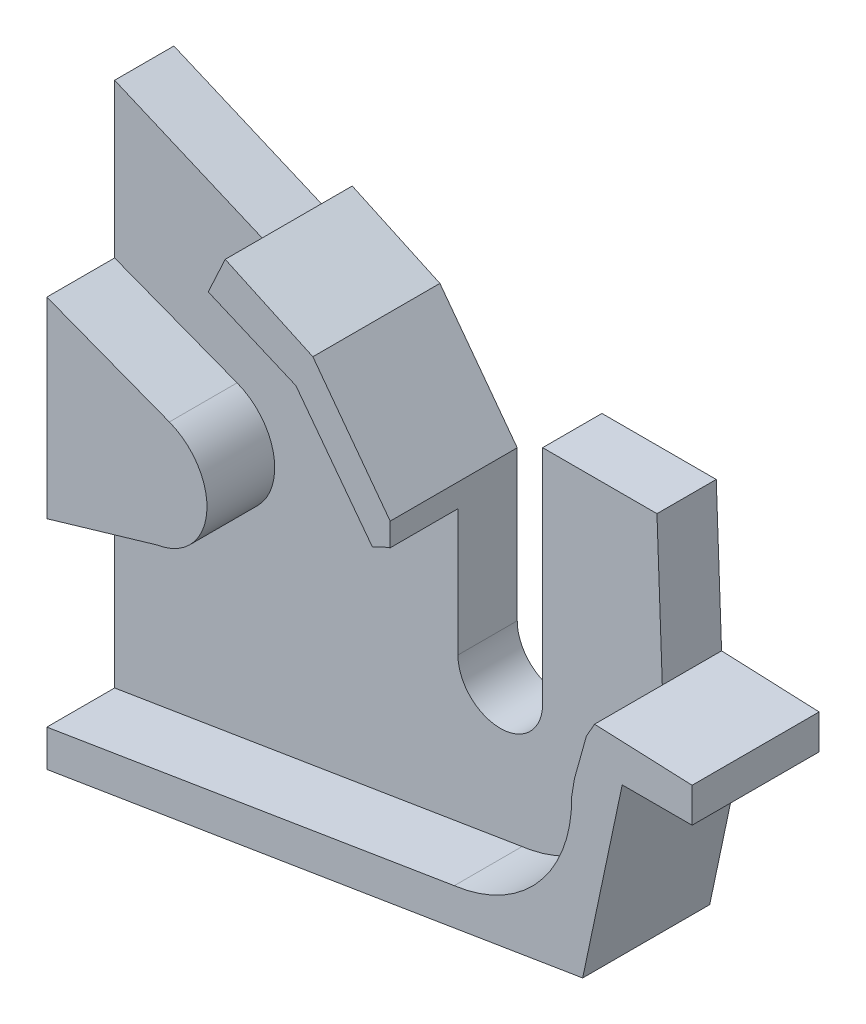
ISO-10303-21;
HEADER;
FILE_DESCRIPTION(('STEP AP214'),'2;1');
FILE_NAME('part.step','',(''),(''),'','','');
FILE_SCHEMA(('AUTOMOTIVE_DESIGN { 1 0 10303 214 1 1 1 1 }'));
ENDSEC;
DATA;
#1=APPLICATION_CONTEXT('core data for automotive mechanical design processes');
#2=APPLICATION_PROTOCOL_DEFINITION('international standard','automotive_design',2000,#1);
#3=PRODUCT_CONTEXT('',#1,'mechanical');
#4=PRODUCT('Part','Part','',(#3));
#5=PRODUCT_RELATED_PRODUCT_CATEGORY('part','',(#4));
#6=PRODUCT_DEFINITION_FORMATION('','',#4);
#7=PRODUCT_DEFINITION_CONTEXT('part definition',#1,'design');
#8=PRODUCT_DEFINITION('design','',#6,#7);
#9=PRODUCT_DEFINITION_SHAPE('','',#8);
#10=(LENGTH_UNIT() NAMED_UNIT(*) SI_UNIT(.MILLI.,.METRE.));
#11=(NAMED_UNIT(*) PLANE_ANGLE_UNIT() SI_UNIT($,.RADIAN.));
#12=(NAMED_UNIT(*) SI_UNIT($,.STERADIAN.) SOLID_ANGLE_UNIT());
#13=UNCERTAINTY_MEASURE_WITH_UNIT(LENGTH_MEASURE(1.E-05),#10,'distance_accuracy_value','');
#14=(GEOMETRIC_REPRESENTATION_CONTEXT(3) GLOBAL_UNCERTAINTY_ASSIGNED_CONTEXT((#13)) GLOBAL_UNIT_ASSIGNED_CONTEXT((#10,
#11,#12)) REPRESENTATION_CONTEXT('',''));
#15=CARTESIAN_POINT('',(0.,0.,0.));
#16=DIRECTION('',(0.,0.,1.));
#17=DIRECTION('',(1.,0.,0.));
#18=AXIS2_PLACEMENT_3D('',#15,#16,#17);
#19=CARTESIAN_POINT('',(0.,0.,7.));
#20=DIRECTION('',(0.,0.,1.));
#21=DIRECTION('',(1.,0.,0.));
#22=AXIS2_PLACEMENT_3D('',#19,#20,#21);
#23=PLANE('',#22);
#24=DIRECTION('',(-0.986991690227506,-0.160771276731423,0.));
#25=VECTOR('',#24,1.);
#26=CARTESIAN_POINT('',(2.22802353362368,-13.6780696031388,7.));
#27=LINE('',#26,#25);
#28=CARTESIAN_POINT('',(6.66593560093297,-12.9551772058192,7.));
#29=VERTEX_POINT('',#28);
#30=CARTESIAN_POINT('',(-41.4462123020663,-20.7921747421138,7.));
#31=VERTEX_POINT('',#30);
#32=EDGE_CURVE('E416',#29,#31,#27,.T.);
#33=ORIENTED_EDGE('',*,*,#32,.F.);
#34=DIRECTION('',(0.986991690227506,0.160771276731423,0.));
#35=VECTOR('',#34,1.);
#36=CARTESIAN_POINT('',(2.22802353362368,-13.6780696031388,7.));
#37=LINE('',#36,#35);
#38=CARTESIAN_POINT('',(7.62985697600266,-12.798163857406,7.));
#39=VERTEX_POINT('',#38);
#40=EDGE_CURVE('E529',#29,#39,#37,.T.);
#41=ORIENTED_EDGE('',*,*,#40,.T.);
#42=CARTESIAN_POINT('',(4.58668043547776,2.84690158384109,7.));
#43=DIRECTION('',(0.,0.,1.));
#44=DIRECTION('',(1.,0.,0.));
#45=AXIS2_PLACEMENT_3D('',#42,#43,#44);
#46=CIRCLE('',#45,15.9382871136676);
#47=CARTESIAN_POINT('',(20.5233035123729,3.07720795083632,7.));
#48=VERTEX_POINT('',#47);
#49=EDGE_CURVE('E419',#48,#39,#46,.F.);
#50=ORIENTED_EDGE('',*,*,#49,.F.);
#51=DIRECTION('',(0.161052296150216,0.98694587384757,0.));
#52=VECTOR('',#51,1.);
#53=CARTESIAN_POINT('',(19.5018514131188,-3.18236088978088,7.));
#54=LINE('',#53,#52);
#55=CARTESIAN_POINT('',(20.8501257943456,5.0800102106292,7.));
#56=VERTEX_POINT('',#55);
#57=EDGE_CURVE('E342',#48,#56,#54,.T.);
#58=ORIENTED_EDGE('',*,*,#57,.T.);
#59=DIRECTION('',(0.268749678176345,0.963210055221659,0.));
#60=VECTOR('',#59,1.);
#61=CARTESIAN_POINT('',(18.0291728908629,-5.03040264783163,7.));
#62=LINE('',#61,#60);
#63=CARTESIAN_POINT('',(22.2571862666276,10.1229736270083,7.));
#64=VERTEX_POINT('',#63);
#65=EDGE_CURVE('E408',#56,#64,#62,.T.);
#66=ORIENTED_EDGE('',*,*,#65,.T.);
#67=DIRECTION('',(0.491293878545191,0.87099387190957,0.));
#68=VECTOR('',#67,1.);
#69=CARTESIAN_POINT('',(12.553214742302,-7.08078180324617,7.));
#70=LINE('',#69,#68);
#71=CARTESIAN_POINT('',(23.2245967998316,11.83805432074,7.));
#72=VERTEX_POINT('',#71);
#73=EDGE_CURVE('E412',#64,#72,#70,.T.);
#74=ORIENTED_EDGE('',*,*,#73,.T.);
#75=DIRECTION('',(0.0365725060444202,-0.999331002121735,0.));
#76=VECTOR('',#75,1.);
#77=CARTESIAN_POINT('',(23.6261904545896,0.864647440510251,7.));
#78=LINE('',#77,#76);
#79=CARTESIAN_POINT('',(22.5946169567633,29.0520343287084,7.));
#80=VERTEX_POINT('',#79);
#81=EDGE_CURVE('E499',#80,#72,#78,.T.);
#82=ORIENTED_EDGE('',*,*,#81,.F.);
#83=DIRECTION('',(1.,0.,0.));
#84=VECTOR('',#83,1.);
#85=CARTESIAN_POINT('',(0.,29.0520343287084,7.));
#86=LINE('',#85,#84);
#87=CARTESIAN_POINT('',(9.09461695676328,29.0520343287084,7.));
#88=VERTEX_POINT('',#87);
#89=EDGE_CURVE('E503',#88,#80,#86,.T.);
#90=ORIENTED_EDGE('',*,*,#89,.F.);
#91=DIRECTION('',(0.,1.,0.));
#92=VECTOR('',#91,1.);
#93=CARTESIAN_POINT('',(9.09461695676327,0.,7.));
#94=LINE('',#93,#92);
#95=CARTESIAN_POINT('',(9.09461695676328,2.84690158384109,7.));
#96=VERTEX_POINT('',#95);
#97=EDGE_CURVE('E508',#96,#88,#94,.T.);
#98=ORIENTED_EDGE('',*,*,#97,.F.);
#99=CARTESIAN_POINT('',(4.09461695676328,2.84690158384109,7.));
#100=DIRECTION('',(0.,0.,1.));
#101=DIRECTION('',(1.,0.,0.));
#102=AXIS2_PLACEMENT_3D('',#99,#100,#101);
#103=CIRCLE('',#102,5.);
#104=CARTESIAN_POINT('',(-0.905383043236726,2.84690158384109,7.));
#105=VERTEX_POINT('',#104);
#106=EDGE_CURVE('E512',#105,#96,#103,.T.);
#107=ORIENTED_EDGE('',*,*,#106,.F.);
#108=DIRECTION('',(0.,1.,0.));
#109=VECTOR('',#108,1.);
#110=CARTESIAN_POINT('',(-0.905383043236726,0.,7.));
#111=LINE('',#110,#109);
#112=CARTESIAN_POINT('',(-0.905383043236726,17.809061684023,7.));
#113=VERTEX_POINT('',#112);
#114=EDGE_CURVE('E516',#105,#113,#111,.T.);
#115=ORIENTED_EDGE('',*,*,#114,.T.);
#116=CARTESIAN_POINT('',(4.58668043547776,2.84690158384109,7.));
#117=DIRECTION('',(0.,0.,1.));
#118=DIRECTION('',(1.,0.,0.));
#119=AXIS2_PLACEMENT_3D('',#116,#117,#118);
#120=CIRCLE('',#119,15.9382871136676);
#121=CARTESIAN_POINT('',(-3.01532871679937,16.8554151725984,7.));
#122=VERTEX_POINT('',#121);
#123=EDGE_CURVE('E468',#122,#113,#120,.F.);
#124=ORIENTED_EDGE('',*,*,#123,.F.);
#125=DIRECTION('',(-0.602062885025692,0.798448672410782,0.));
#126=VECTOR('',#125,1.);
#127=CARTESIAN_POINT('',(6.18033979118199,4.66022843257203,7.));
#128=LINE('',#127,#126);
#129=CARTESIAN_POINT('',(-12.0436307526977,28.8286424782127,7.));
#130=VERTEX_POINT('',#129);
#131=EDGE_CURVE('E460',#122,#130,#128,.T.);
#132=ORIENTED_EDGE('',*,*,#131,.T.);
#133=DIRECTION('',(-0.919991320348267,0.391938733074254,0.));
#134=VECTOR('',#133,1.);
#135=CARTESIAN_POINT('',(8.54494458228394,20.0574074087973,7.));
#136=LINE('',#135,#134);
#137=CARTESIAN_POINT('',(-22.3905109942516,33.2366657317479,7.));
#138=VERTEX_POINT('',#137);
#139=EDGE_CURVE('E464',#130,#138,#136,.T.);
#140=ORIENTED_EDGE('',*,*,#139,.T.);
#141=DIRECTION('',(0.919991320348267,-0.391938733074254,0.));
#142=VECTOR('',#141,1.);
#143=CARTESIAN_POINT('',(8.54494458228394,20.0574074087973,7.));
#144=LINE('',#143,#142);
#145=CARTESIAN_POINT('',(-41.4462123020663,41.3548590920928,7.));
#146=VERTEX_POINT('',#145);
#147=EDGE_CURVE('E520',#146,#138,#144,.T.);
#148=ORIENTED_EDGE('',*,*,#147,.F.);
#149=DIRECTION('',(0.,-1.,0.));
#150=VECTOR('',#149,1.);
#151=CARTESIAN_POINT('',(-41.4462123020663,0.,7.));
#152=LINE('',#151,#150);
#153=CARTESIAN_POINT('',(-41.4462123020663,23.1809754877137,7.));
#154=VERTEX_POINT('',#153);
#155=EDGE_CURVE('E525',#146,#154,#152,.T.);
#156=ORIENTED_EDGE('',*,*,#155,.T.);
#157=DIRECTION('',(-0.933859309772782,0.357640587113241,0.));
#158=VECTOR('',#157,1.);
#159=CARTESIAN_POINT('',(2.44086913521748,6.37351701119464,7.));
#160=LINE('',#159,#158);
#161=CARTESIAN_POINT('',(-26.9826443207978,17.6418553114296,7.));
#162=VERTEX_POINT('',#161);
#163=EDGE_CURVE('E12',#162,#154,#160,.T.);
#164=ORIENTED_EDGE('',*,*,#163,.F.);
#165=CARTESIAN_POINT('',(-29.4561448052709,11.1831323969039,7.));
#166=DIRECTION('',(0.,0.,1.));
#167=DIRECTION('',(1.,0.,0.));
#168=AXIS2_PLACEMENT_3D('',#165,#166,#167);
#169=CIRCLE('',#168,6.91616268846454);
#170=CARTESIAN_POINT('',(-28.3713264112049,4.35257785241738,7.));
#171=VERTEX_POINT('',#170);
#172=EDGE_CURVE('E599',#162,#171,#169,.F.);
#173=ORIENTED_EDGE('',*,*,#172,.T.);
#174=DIRECTION('',(-0.959538583302517,-0.281577177970443,0.));
#175=VECTOR('',#174,1.);
#176=CARTESIAN_POINT('',(-3.42543829632457,11.6729638166573,7.));
#177=LINE('',#176,#175);
#178=CARTESIAN_POINT('',(-41.4462123020663,0.515744674992557,7.));
#179=VERTEX_POINT('',#178);
#180=EDGE_CURVE('E143',#171,#179,#177,.T.);
#181=ORIENTED_EDGE('',*,*,#180,.T.);
#182=EDGE_CURVE('E524',#179,#31,#152,.T.);
#183=ORIENTED_EDGE('',*,*,#182,.T.);
#184=EDGE_LOOP('',(#33,#41,#50,#58,#66,#74,#82,#90,#98,#107,#115,#124,#132,#140,#148,#156,#164,
#173,#181,#183));
#185=FACE_BOUND('',#184,.T.);
#186=ADVANCED_FACE('F134',(#185),#23,.T.);
#187=CARTESIAN_POINT('',(4.58668043547776,2.84690158384109,7.));
#188=DIRECTION('',(0.,0.,-1.));
#189=DIRECTION('',(-1.,0.,0.));
#190=AXIS2_PLACEMENT_3D('',#187,#188,#189);
#191=CYLINDRICAL_SURFACE('',#190,15.9382871136676);
#192=CARTESIAN_POINT('',(4.58668043547776,2.84690158384109,0.));
#193=DIRECTION('',(0.,0.,1.));
#194=DIRECTION('',(1.,0.,0.));
#195=AXIS2_PLACEMENT_3D('',#192,#193,#194);
#196=CIRCLE('',#195,15.9382871136676);
#197=CARTESIAN_POINT('',(6.66593560093297,-12.9551772058192,0.));
#198=VERTEX_POINT('',#197);
#199=CARTESIAN_POINT('',(7.62985697600271,-12.798163857406,0.));
#200=VERTEX_POINT('',#199);
#201=EDGE_CURVE('E504',#198,#200,#196,.T.);
#202=ORIENTED_EDGE('',*,*,#201,.F.);
#203=DIRECTION('',(0.,0.,-1.));
#204=VECTOR('',#203,1.);
#205=CARTESIAN_POINT('',(6.66593560093297,-12.9551772058192,7.));
#206=LINE('',#205,#204);
#207=EDGE_CURVE('E336',#29,#198,#206,.T.);
#208=ORIENTED_EDGE('',*,*,#207,.F.);
#209=DIRECTION('',(0.,0.,-1.));
#210=VECTOR('',#209,1.);
#211=CARTESIAN_POINT('',(6.66593560093297,-12.9551772058192,15.));
#212=LINE('',#211,#210);
#213=CARTESIAN_POINT('',(6.66593560093297,-12.9551772058192,15.));
#214=VERTEX_POINT('',#213);
#215=EDGE_CURVE('E330',#214,#29,#212,.T.);
#216=ORIENTED_EDGE('',*,*,#215,.F.);
#217=CARTESIAN_POINT('',(4.58668043547776,2.84690158384109,15.));
#218=DIRECTION('',(0.,0.,1.));
#219=DIRECTION('',(1.,0.,0.));
#220=AXIS2_PLACEMENT_3D('',#217,#218,#219);
#221=CIRCLE('',#220,15.9382871136676);
#222=CARTESIAN_POINT('',(20.5233035123729,3.07720795083632,15.));
#223=VERTEX_POINT('',#222);
#224=EDGE_CURVE('E335',#214,#223,#221,.T.);
#225=ORIENTED_EDGE('',*,*,#224,.T.);
#226=DIRECTION('',(0.,0.,-1.));
#227=VECTOR('',#226,1.);
#228=CARTESIAN_POINT('',(20.5233035123729,3.07720795083632,15.));
#229=LINE('',#228,#227);
#230=EDGE_CURVE('E391',#223,#48,#229,.T.);
#231=ORIENTED_EDGE('',*,*,#230,.T.);
#232=ORIENTED_EDGE('',*,*,#49,.T.);
#233=DIRECTION('',(0.,0.,-1.));
#234=VECTOR('',#233,1.);
#235=CARTESIAN_POINT('',(7.62985697600271,-12.798163857406,7.));
#236=LINE('',#235,#234);
#237=EDGE_CURVE('E595',#39,#200,#236,.T.);
#238=ORIENTED_EDGE('',*,*,#237,.T.);
#239=EDGE_LOOP('',(#202,#208,#216,#225,#231,#232,#238));
#240=FACE_BOUND('',#239,.T.);
#241=ADVANCED_FACE('F333',(#240),#191,.F.);
#242=CARTESIAN_POINT('',(2.22802353362368,-13.6780696031388,7.));
#243=DIRECTION('',(-0.160771276731423,0.986991690227506,0.));
#244=DIRECTION('',(-0.986991690227506,-0.160771276731423,0.));
#245=AXIS2_PLACEMENT_3D('',#242,#243,#244);
#246=PLANE('',#245);
#247=DIRECTION('',(0.986991690227506,0.160771276731423,0.));
#248=VECTOR('',#247,1.);
#249=CARTESIAN_POINT('',(2.22802353362368,-13.6780696031388,0.));
#250=LINE('',#249,#248);
#251=EDGE_CURVE('E586',#198,#200,#250,.T.);
#252=ORIENTED_EDGE('',*,*,#251,.T.);
#253=ORIENTED_EDGE('',*,*,#237,.F.);
#254=ORIENTED_EDGE('',*,*,#40,.F.);
#255=ORIENTED_EDGE('',*,*,#207,.T.);
#256=EDGE_LOOP('',(#252,#253,#254,#255));
#257=FACE_BOUND('',#256,.T.);
#258=ADVANCED_FACE('F701',(#257),#246,.F.);
#259=CARTESIAN_POINT('',(23.6261904545896,0.864647440510251,7.));
#260=DIRECTION('',(0.999331002121735,0.0365725060444202,0.));
#261=DIRECTION('',(-0.0365725060444202,0.999331002121735,0.));
#262=AXIS2_PLACEMENT_3D('',#259,#260,#261);
#263=PLANE('',#262);
#264=DIRECTION('',(0.0365725060444202,-0.999331002121735,0.));
#265=VECTOR('',#264,1.);
#266=CARTESIAN_POINT('',(23.6261904545896,0.864647440510251,0.));
#267=LINE('',#266,#265);
#268=CARTESIAN_POINT('',(22.5946169567633,29.0520343287084,0.));
#269=VERTEX_POINT('',#268);
#270=CARTESIAN_POINT('',(23.2245967998316,11.83805432074,0.));
#271=VERTEX_POINT('',#270);
#272=EDGE_CURVE('E537',#269,#271,#267,.T.);
#273=ORIENTED_EDGE('',*,*,#272,.F.);
#274=DIRECTION('',(0.,0.,-1.));
#275=VECTOR('',#274,1.);
#276=CARTESIAN_POINT('',(22.5946169567633,29.0520343287084,7.));
#277=LINE('',#276,#275);
#278=EDGE_CURVE('E645',#80,#269,#277,.T.);
#279=ORIENTED_EDGE('',*,*,#278,.F.);
#280=ORIENTED_EDGE('',*,*,#81,.T.);
#281=DIRECTION('',(0.,0.,-1.));
#282=VECTOR('',#281,1.);
#283=CARTESIAN_POINT('',(23.2245967998316,11.83805432074,7.));
#284=LINE('',#283,#282);
#285=EDGE_CURVE('E596',#72,#271,#284,.T.);
#286=ORIENTED_EDGE('',*,*,#285,.T.);
#287=EDGE_LOOP('',(#273,#279,#280,#286));
#288=FACE_BOUND('',#287,.T.);
#289=ADVANCED_FACE('F926',(#288),#263,.T.);
#290=CARTESIAN_POINT('',(0.,29.0520343287084,7.));
#291=DIRECTION('',(0.,1.,0.));
#292=DIRECTION('',(0.,0.,1.));
#293=AXIS2_PLACEMENT_3D('',#290,#291,#292);
#294=PLANE('',#293);
#295=DIRECTION('',(1.,0.,0.));
#296=VECTOR('',#295,1.);
#297=CARTESIAN_POINT('',(0.,29.0520343287084,0.));
#298=LINE('',#297,#296);
#299=CARTESIAN_POINT('',(9.09461695676328,29.0520343287084,0.));
#300=VERTEX_POINT('',#299);
#301=EDGE_CURVE('E541',#300,#269,#298,.T.);
#302=ORIENTED_EDGE('',*,*,#301,.F.);
#303=DIRECTION('',(0.,0.,-1.));
#304=VECTOR('',#303,1.);
#305=CARTESIAN_POINT('',(9.09461695676328,29.0520343287084,7.));
#306=LINE('',#305,#304);
#307=EDGE_CURVE('E642',#88,#300,#306,.T.);
#308=ORIENTED_EDGE('',*,*,#307,.F.);
#309=ORIENTED_EDGE('',*,*,#89,.T.);
#310=ORIENTED_EDGE('',*,*,#278,.T.);
#311=EDGE_LOOP('',(#302,#308,#309,#310));
#312=FACE_BOUND('',#311,.T.);
#313=ADVANCED_FACE('F931',(#312),#294,.T.);
#314=CARTESIAN_POINT('',(9.09461695676327,0.,7.));
#315=DIRECTION('',(-1.,0.,0.));
#316=DIRECTION('',(0.,-1.,0.));
#317=AXIS2_PLACEMENT_3D('',#314,#315,#316);
#318=PLANE('',#317);
#319=DIRECTION('',(0.,1.,0.));
#320=VECTOR('',#319,1.);
#321=CARTESIAN_POINT('',(9.09461695676327,0.,0.));
#322=LINE('',#321,#320);
#323=CARTESIAN_POINT('',(9.09461695676328,2.84690158384109,0.));
#324=VERTEX_POINT('',#323);
#325=EDGE_CURVE('E545',#324,#300,#322,.T.);
#326=ORIENTED_EDGE('',*,*,#325,.F.);
#327=DIRECTION('',(0.,0.,-1.));
#328=VECTOR('',#327,1.);
#329=CARTESIAN_POINT('',(9.09461695676328,2.84690158384109,7.));
#330=LINE('',#329,#328);
#331=EDGE_CURVE('E639',#96,#324,#330,.T.);
#332=ORIENTED_EDGE('',*,*,#331,.F.);
#333=ORIENTED_EDGE('',*,*,#97,.T.);
#334=ORIENTED_EDGE('',*,*,#307,.T.);
#335=EDGE_LOOP('',(#326,#332,#333,#334));
#336=FACE_BOUND('',#335,.T.);
#337=ADVANCED_FACE('F960',(#336),#318,.T.);
#338=CARTESIAN_POINT('',(4.09461695676328,2.84690158384109,7.));
#339=DIRECTION('',(0.,0.,-1.));
#340=DIRECTION('',(-1.,0.,0.));
#341=AXIS2_PLACEMENT_3D('',#338,#339,#340);
#342=CYLINDRICAL_SURFACE('',#341,5.);
#343=CARTESIAN_POINT('',(4.09461695676328,2.84690158384109,0.));
#344=DIRECTION('',(0.,0.,1.));
#345=DIRECTION('',(1.,0.,0.));
#346=AXIS2_PLACEMENT_3D('',#343,#344,#345);
#347=CIRCLE('',#346,5.);
#348=CARTESIAN_POINT('',(-0.905383043236726,2.84690158384109,0.));
#349=VERTEX_POINT('',#348);
#350=EDGE_CURVE('E549',#349,#324,#347,.T.);
#351=ORIENTED_EDGE('',*,*,#350,.F.);
#352=DIRECTION('',(0.,0.,-1.));
#353=VECTOR('',#352,1.);
#354=CARTESIAN_POINT('',(-0.905383043236726,2.84690158384109,7.));
#355=LINE('',#354,#353);
#356=EDGE_CURVE('E636',#105,#349,#355,.T.);
#357=ORIENTED_EDGE('',*,*,#356,.F.);
#358=ORIENTED_EDGE('',*,*,#106,.T.);
#359=ORIENTED_EDGE('',*,*,#331,.T.);
#360=EDGE_LOOP('',(#351,#357,#358,#359));
#361=FACE_BOUND('',#360,.T.);
#362=ADVANCED_FACE('F917',(#361),#342,.F.);
#363=CARTESIAN_POINT('',(-0.905383043236726,0.,7.));
#364=DIRECTION('',(-1.,0.,0.));
#365=DIRECTION('',(0.,0.,1.));
#366=AXIS2_PLACEMENT_3D('',#363,#364,#365);
#367=PLANE('',#366);
#368=DIRECTION('',(0.,1.,0.));
#369=VECTOR('',#368,1.);
#370=CARTESIAN_POINT('',(-0.905383043236726,0.,0.));
#371=LINE('',#370,#369);
#372=CARTESIAN_POINT('',(-0.905383043236726,20.5391363305154,0.));
#373=VERTEX_POINT('',#372);
#374=EDGE_CURVE('E553',#349,#373,#371,.T.);
#375=ORIENTED_EDGE('',*,*,#374,.T.);
#376=DIRECTION('',(0.,0.,-1.));
#377=VECTOR('',#376,1.);
#378=CARTESIAN_POINT('',(-0.905383043236726,20.5391363305154,7.));
#379=LINE('',#378,#377);
#380=CARTESIAN_POINT('',(-0.905383043236726,20.5391363305154,15.));
#381=VERTEX_POINT('',#380);
#382=EDGE_CURVE('E632',#381,#373,#379,.T.);
#383=ORIENTED_EDGE('',*,*,#382,.F.);
#384=DIRECTION('',(0.,1.,0.));
#385=VECTOR('',#384,1.);
#386=CARTESIAN_POINT('',(-0.905383043236726,0.,15.));
#387=LINE('',#386,#385);
#388=CARTESIAN_POINT('',(-0.905383043236726,17.809061684023,15.));
#389=VERTEX_POINT('',#388);
#390=EDGE_CURVE('E426',#389,#381,#387,.T.);
#391=ORIENTED_EDGE('',*,*,#390,.F.);
#392=DIRECTION('',(0.,0.,-1.));
#393=VECTOR('',#392,1.);
#394=CARTESIAN_POINT('',(-0.905383043236726,17.809061684023,15.));
#395=LINE('',#394,#393);
#396=EDGE_CURVE('E456',#389,#113,#395,.T.);
#397=ORIENTED_EDGE('',*,*,#396,.T.);
#398=ORIENTED_EDGE('',*,*,#114,.F.);
#399=ORIENTED_EDGE('',*,*,#356,.T.);
#400=EDGE_LOOP('',(#375,#383,#391,#397,#398,#399));
#401=FACE_BOUND('',#400,.T.);
#402=ADVANCED_FACE('F906',(#401),#367,.F.);
#403=CARTESIAN_POINT('',(9.26114189402648,6.90647430874386,7.));
#404=DIRECTION('',(-0.801633281882219,-0.597816093275133,0.));
#405=DIRECTION('',(0.597816093275133,-0.801633281882219,0.));
#406=AXIS2_PLACEMENT_3D('',#403,#404,#405);
#407=PLANE('',#406);
#408=DIRECTION('',(-0.597816093275133,0.801633281882219,0.));
#409=VECTOR('',#408,1.);
#410=CARTESIAN_POINT('',(9.26114189402648,6.90647430874386,0.));
#411=LINE('',#410,#409);
#412=CARTESIAN_POINT('',(-10.0368202056355,32.7838116129957,0.));
#413=VERTEX_POINT('',#412);
#414=EDGE_CURVE('E556',#373,#413,#411,.T.);
#415=ORIENTED_EDGE('',*,*,#414,.T.);
#416=DIRECTION('',(0.,0.,-1.));
#417=VECTOR('',#416,1.);
#418=CARTESIAN_POINT('',(-10.0368202056355,32.7838116129957,7.));
#419=LINE('',#418,#417);
#420=CARTESIAN_POINT('',(-10.0368202056355,32.7838116129957,15.));
#421=VERTEX_POINT('',#420);
#422=EDGE_CURVE('E628',#421,#413,#419,.T.);
#423=ORIENTED_EDGE('',*,*,#422,.F.);
#424=DIRECTION('',(-0.597816093275133,0.801633281882219,0.));
#425=VECTOR('',#424,1.);
#426=CARTESIAN_POINT('',(9.26114189402648,6.90647430874386,15.));
#427=LINE('',#426,#425);
#428=EDGE_CURVE('E430',#381,#421,#427,.T.);
#429=ORIENTED_EDGE('',*,*,#428,.F.);
#430=ORIENTED_EDGE('',*,*,#382,.T.);
#431=EDGE_LOOP('',(#415,#423,#429,#430));
#432=FACE_BOUND('',#431,.T.);
#433=ADVANCED_FACE('F895',(#432),#407,.F.);
#434=CARTESIAN_POINT('',(10.7214720768776,23.1841900245257,7.));
#435=DIRECTION('',(-0.419738295272975,-0.907645174879114,0.));
#436=DIRECTION('',(0.907645174879114,-0.419738295272975,0.));
#437=AXIS2_PLACEMENT_3D('',#434,#435,#436);
#438=PLANE('',#437);
#439=DIRECTION('',(-0.907645174879114,0.419738295272975,0.));
#440=VECTOR('',#439,1.);
#441=CARTESIAN_POINT('',(10.7214720768776,23.1841900245257,0.));
#442=LINE('',#441,#440);
#443=CARTESIAN_POINT('',(-20.3865602199569,37.5700236156193,0.));
#444=VERTEX_POINT('',#443);
#445=EDGE_CURVE('E559',#413,#444,#442,.T.);
#446=ORIENTED_EDGE('',*,*,#445,.T.);
#447=DIRECTION('',(0.,0.,-1.));
#448=VECTOR('',#447,1.);
#449=CARTESIAN_POINT('',(-20.3865602199569,37.5700236156193,7.));
#450=LINE('',#449,#448);
#451=CARTESIAN_POINT('',(-20.3865602199569,37.5700236156193,15.));
#452=VERTEX_POINT('',#451);
#453=EDGE_CURVE('E624',#452,#444,#450,.T.);
#454=ORIENTED_EDGE('',*,*,#453,.F.);
#455=DIRECTION('',(-0.907645174879114,0.419738295272975,0.));
#456=VECTOR('',#455,1.);
#457=CARTESIAN_POINT('',(10.7214720768776,23.1841900245257,15.));
#458=LINE('',#457,#456);
#459=EDGE_CURVE('E434',#421,#452,#458,.T.);
#460=ORIENTED_EDGE('',*,*,#459,.F.);
#461=ORIENTED_EDGE('',*,*,#422,.T.);
#462=EDGE_LOOP('',(#446,#454,#460,#461));
#463=FACE_BOUND('',#462,.T.);
#464=ADVANCED_FACE('F885',(#463),#438,.F.);
#465=CARTESIAN_POINT('',(-31.1080322968345,14.3858335910936,7.));
#466=DIRECTION('',(0.907645174879114,-0.419738295272975,0.));
#467=DIRECTION('',(0.419738295272975,0.907645174879114,0.));
#468=AXIS2_PLACEMENT_3D('',#465,#466,#467);
#469=PLANE('',#468);
#470=DIRECTION('',(-0.419738295272975,-0.907645174879114,0.));
#471=VECTOR('',#470,1.);
#472=CARTESIAN_POINT('',(-31.1080322968345,14.3858335910936,0.));
#473=LINE('',#472,#471);
#474=CARTESIAN_POINT('',(-22.3905109942516,33.2366657317479,0.));
#475=VERTEX_POINT('',#474);
#476=EDGE_CURVE('E562',#444,#475,#473,.T.);
#477=ORIENTED_EDGE('',*,*,#476,.T.);
#478=DIRECTION('',(0.,0.,-1.));
#479=VECTOR('',#478,1.);
#480=CARTESIAN_POINT('',(-22.3905109942516,33.2366657317479,7.));
#481=LINE('',#480,#479);
#482=EDGE_CURVE('E621',#138,#475,#481,.T.);
#483=ORIENTED_EDGE('',*,*,#482,.F.);
#484=DIRECTION('',(0.,0.,-1.));
#485=VECTOR('',#484,1.);
#486=CARTESIAN_POINT('',(-22.3905109942516,33.2366657317479,15.));
#487=LINE('',#486,#485);
#488=CARTESIAN_POINT('',(-22.3905109942516,33.2366657317479,15.));
#489=VERTEX_POINT('',#488);
#490=EDGE_CURVE('E453',#489,#138,#487,.T.);
#491=ORIENTED_EDGE('',*,*,#490,.F.);
#492=DIRECTION('',(-0.419738295272975,-0.907645174879114,0.));
#493=VECTOR('',#492,1.);
#494=CARTESIAN_POINT('',(-31.1080322968345,14.3858335910936,15.));
#495=LINE('',#494,#493);
#496=EDGE_CURVE('E438',#452,#489,#495,.T.);
#497=ORIENTED_EDGE('',*,*,#496,.F.);
#498=ORIENTED_EDGE('',*,*,#453,.T.);
#499=EDGE_LOOP('',(#477,#483,#491,#497,#498));
#500=FACE_BOUND('',#499,.T.);
#501=ADVANCED_FACE('F873',(#500),#469,.F.);
#502=CARTESIAN_POINT('',(8.54494458228394,20.0574074087973,7.));
#503=DIRECTION('',(0.391938733074254,0.919991320348267,0.));
#504=DIRECTION('',(-0.919991320348267,0.391938733074254,0.));
#505=AXIS2_PLACEMENT_3D('',#502,#503,#504);
#506=PLANE('',#505);
#507=DIRECTION('',(0.919991320348267,-0.391938733074254,0.));
#508=VECTOR('',#507,1.);
#509=CARTESIAN_POINT('',(8.54494458228394,20.0574074087973,0.));
#510=LINE('',#509,#508);
#511=CARTESIAN_POINT('',(-41.4462123020663,41.3548590920928,0.));
#512=VERTEX_POINT('',#511);
#513=EDGE_CURVE('E566',#512,#475,#510,.T.);
#514=ORIENTED_EDGE('',*,*,#513,.F.);
#515=DIRECTION('',(0.,0.,-1.));
#516=VECTOR('',#515,1.);
#517=CARTESIAN_POINT('',(-41.4462123020663,41.3548590920928,7.));
#518=LINE('',#517,#516);
#519=EDGE_CURVE('E618',#146,#512,#518,.T.);
#520=ORIENTED_EDGE('',*,*,#519,.F.);
#521=ORIENTED_EDGE('',*,*,#147,.T.);
#522=ORIENTED_EDGE('',*,*,#482,.T.);
#523=EDGE_LOOP('',(#514,#520,#521,#522));
#524=FACE_BOUND('',#523,.T.);
#525=ADVANCED_FACE('F863',(#524),#506,.T.);
#526=CARTESIAN_POINT('',(-41.4462123020663,0.,7.));
#527=DIRECTION('',(1.,0.,0.));
#528=DIRECTION('',(0.,1.,0.));
#529=AXIS2_PLACEMENT_3D('',#526,#527,#528);
#530=PLANE('',#529);
#531=DIRECTION('',(0.,-1.,0.));
#532=VECTOR('',#531,1.);
#533=CARTESIAN_POINT('',(-41.4462123020663,0.,0.));
#534=LINE('',#533,#532);
#535=CARTESIAN_POINT('',(-41.4462123020663,-25.1234009808684,0.));
#536=VERTEX_POINT('',#535);
#537=EDGE_CURVE('E570',#512,#536,#534,.T.);
#538=ORIENTED_EDGE('',*,*,#537,.T.);
#539=DIRECTION('',(0.,0.,-1.));
#540=VECTOR('',#539,1.);
#541=CARTESIAN_POINT('',(-41.4462123020663,-25.1234009808684,7.));
#542=LINE('',#541,#540);
#543=CARTESIAN_POINT('',(-41.4462123020663,-25.1234009808684,15.));
#544=VERTEX_POINT('',#543);
#545=EDGE_CURVE('E614',#544,#536,#542,.T.);
#546=ORIENTED_EDGE('',*,*,#545,.F.);
#547=DIRECTION('',(0.,-1.,0.));
#548=VECTOR('',#547,1.);
#549=CARTESIAN_POINT('',(-41.4462123020663,0.,15.));
#550=LINE('',#549,#548);
#551=CARTESIAN_POINT('',(-41.4462123020663,-20.7921747421138,15.));
#552=VERTEX_POINT('',#551);
#553=EDGE_CURVE('E358',#552,#544,#550,.T.);
#554=ORIENTED_EDGE('',*,*,#553,.F.);
#555=DIRECTION('',(0.,0.,-1.));
#556=VECTOR('',#555,1.);
#557=CARTESIAN_POINT('',(-41.4462123020663,-20.7921747421138,15.));
#558=LINE('',#557,#556);
#559=EDGE_CURVE('E343',#552,#31,#558,.T.);
#560=ORIENTED_EDGE('',*,*,#559,.T.);
#561=ORIENTED_EDGE('',*,*,#182,.F.);
#562=DIRECTION('',(0.,0.,-1.));
#563=VECTOR('',#562,1.);
#564=CARTESIAN_POINT('',(-41.4462123020663,0.515744674992557,15.));
#565=LINE('',#564,#563);
#566=CARTESIAN_POINT('',(-41.4462123020663,0.515744674992557,15.));
#567=VERTEX_POINT('',#566);
#568=EDGE_CURVE('E491',#567,#179,#565,.T.);
#569=ORIENTED_EDGE('',*,*,#568,.F.);
#570=DIRECTION('',(0.,-1.,0.));
#571=VECTOR('',#570,1.);
#572=CARTESIAN_POINT('',(-41.4462123020663,0.,15.));
#573=LINE('',#572,#571);
#574=CARTESIAN_POINT('',(-41.4462123020663,23.1809754877137,15.));
#575=VERTEX_POINT('',#574);
#576=EDGE_CURVE('E475',#575,#567,#573,.T.);
#577=ORIENTED_EDGE('',*,*,#576,.F.);
#578=DIRECTION('',(0.,0.,-1.));
#579=VECTOR('',#578,1.);
#580=CARTESIAN_POINT('',(-41.4462123020663,23.1809754877137,15.));
#581=LINE('',#580,#579);
#582=EDGE_CURVE('E494',#575,#154,#581,.T.);
#583=ORIENTED_EDGE('',*,*,#582,.T.);
#584=ORIENTED_EDGE('',*,*,#155,.F.);
#585=ORIENTED_EDGE('',*,*,#519,.T.);
#586=EDGE_LOOP('',(#538,#546,#554,#560,#561,#569,#577,#583,#584,#585));
#587=FACE_BOUND('',#586,.T.);
#588=ADVANCED_FACE('F663',(#587),#530,.F.);
#589=CARTESIAN_POINT('',(2.9153021414019,-17.8973448899889,7.));
#590=DIRECTION('',(-0.160771276731423,0.986991690227506,0.));
#591=DIRECTION('',(-0.986991690227506,-0.160771276731423,0.));
#592=AXIS2_PLACEMENT_3D('',#589,#590,#591);
#593=PLANE('',#592);
#594=DIRECTION('',(0.986991690227506,0.160771276731423,0.));
#595=VECTOR('',#594,1.);
#596=CARTESIAN_POINT('',(2.9153021414019,-17.8973448899889,0.));
#597=LINE('',#596,#595);
#598=CARTESIAN_POINT('',(21.8226728247008,-14.8175194421297,0.));
#599=VERTEX_POINT('',#598);
#600=EDGE_CURVE('E573',#536,#599,#597,.T.);
#601=ORIENTED_EDGE('',*,*,#600,.T.);
#602=DIRECTION('',(0.,0.,-1.));
#603=VECTOR('',#602,1.);
#604=CARTESIAN_POINT('',(21.8226728247008,-14.8175194421297,7.));
#605=LINE('',#604,#603);
#606=CARTESIAN_POINT('',(21.8226728247008,-14.8175194421297,15.));
#607=VERTEX_POINT('',#606);
#608=EDGE_CURVE('E610',#607,#599,#605,.T.);
#609=ORIENTED_EDGE('',*,*,#608,.F.);
#610=DIRECTION('',(0.986991690227506,0.160771276731423,0.));
#611=VECTOR('',#610,1.);
#612=CARTESIAN_POINT('',(2.9153021414019,-17.8973448899889,15.));
#613=LINE('',#612,#611);
#614=EDGE_CURVE('E361',#544,#607,#613,.T.);
#615=ORIENTED_EDGE('',*,*,#614,.F.);
#616=ORIENTED_EDGE('',*,*,#545,.T.);
#617=EDGE_LOOP('',(#601,#609,#615,#616));
#618=FACE_BOUND('',#617,.T.);
#619=ADVANCED_FACE('F670',(#618),#593,.F.);
#620=CARTESIAN_POINT('',(23.8872555836264,-5.04814442659853,7.));
#621=DIRECTION('',(-0.97839056027552,0.206765353876691,0.));
#622=DIRECTION('',(-0.206765353876691,-0.97839056027552,0.));
#623=AXIS2_PLACEMENT_3D('',#620,#621,#622);
#624=PLANE('',#623);
#625=DIRECTION('',(0.206765353876691,0.97839056027552,0.));
#626=VECTOR('',#625,1.);
#627=CARTESIAN_POINT('',(23.8872555836264,-5.04814442659853,0.));
#628=LINE('',#627,#626);
#629=CARTESIAN_POINT('',(26.4898011963491,7.26681072634678,0.));
#630=VERTEX_POINT('',#629);
#631=EDGE_CURVE('E576',#599,#630,#628,.T.);
#632=ORIENTED_EDGE('',*,*,#631,.T.);
#633=DIRECTION('',(0.,0.,-1.));
#634=VECTOR('',#633,1.);
#635=CARTESIAN_POINT('',(26.4898011963491,7.26681072634678,7.));
#636=LINE('',#635,#634);
#637=CARTESIAN_POINT('',(26.4898011963491,7.26681072634678,15.));
#638=VERTEX_POINT('',#637);
#639=EDGE_CURVE('E606',#638,#630,#636,.T.);
#640=ORIENTED_EDGE('',*,*,#639,.F.);
#641=DIRECTION('',(0.206765353876691,0.97839056027552,0.));
#642=VECTOR('',#641,1.);
#643=CARTESIAN_POINT('',(23.8872555836264,-5.04814442659853,15.));
#644=LINE('',#643,#642);
#645=EDGE_CURVE('E367',#607,#638,#644,.T.);
#646=ORIENTED_EDGE('',*,*,#645,.F.);
#647=ORIENTED_EDGE('',*,*,#608,.T.);
#648=EDGE_LOOP('',(#632,#640,#646,#647));
#649=FACE_BOUND('',#648,.T.);
#650=ADVANCED_FACE('F674',(#649),#624,.F.);
#651=CARTESIAN_POINT('',(0.,7.26681072634678,7.));
#652=DIRECTION('',(0.,1.,0.));
#653=DIRECTION('',(0.,0.,1.));
#654=AXIS2_PLACEMENT_3D('',#651,#652,#653);
#655=PLANE('',#654);
#656=DIRECTION('',(1.,0.,0.));
#657=VECTOR('',#656,1.);
#658=CARTESIAN_POINT('',(0.,7.26681072634678,0.));
#659=LINE('',#658,#657);
#660=CARTESIAN_POINT('',(34.744303122736,7.26681072634678,0.));
#661=VERTEX_POINT('',#660);
#662=EDGE_CURVE('E579',#630,#661,#659,.T.);
#663=ORIENTED_EDGE('',*,*,#662,.T.);
#664=DIRECTION('',(0.,0.,-1.));
#665=VECTOR('',#664,1.);
#666=CARTESIAN_POINT('',(34.744303122736,7.26681072634678,7.));
#667=LINE('',#666,#665);
#668=CARTESIAN_POINT('',(34.744303122736,7.26681072634678,15.));
#669=VERTEX_POINT('',#668);
#670=EDGE_CURVE('E602',#669,#661,#667,.T.);
#671=ORIENTED_EDGE('',*,*,#670,.F.);
#672=DIRECTION('',(1.,0.,0.));
#673=VECTOR('',#672,1.);
#674=CARTESIAN_POINT('',(0.,7.26681072634678,15.));
#675=LINE('',#674,#673);
#676=EDGE_CURVE('E371',#638,#669,#675,.T.);
#677=ORIENTED_EDGE('',*,*,#676,.F.);
#678=ORIENTED_EDGE('',*,*,#639,.T.);
#679=EDGE_LOOP('',(#663,#671,#677,#678));
#680=FACE_BOUND('',#679,.T.);
#681=ADVANCED_FACE('F681',(#680),#655,.F.);
#682=CARTESIAN_POINT('',(34.744303122736,0.,7.));
#683=DIRECTION('',(-1.,0.,0.));
#684=DIRECTION('',(0.,0.,1.));
#685=AXIS2_PLACEMENT_3D('',#682,#683,#684);
#686=PLANE('',#685);
#687=DIRECTION('',(0.,1.,0.));
#688=VECTOR('',#687,1.);
#689=CARTESIAN_POINT('',(34.744303122736,0.,0.));
#690=LINE('',#689,#688);
#691=CARTESIAN_POINT('',(34.744303122736,11.3546415658289,0.));
#692=VERTEX_POINT('',#691);
#693=EDGE_CURVE('E582',#661,#692,#690,.T.);
#694=ORIENTED_EDGE('',*,*,#693,.T.);
#695=DIRECTION('',(0.,0.,-1.));
#696=VECTOR('',#695,1.);
#697=CARTESIAN_POINT('',(34.744303122736,11.3546415658289,7.));
#698=LINE('',#697,#696);
#699=CARTESIAN_POINT('',(34.744303122736,11.3546415658289,15.));
#700=VERTEX_POINT('',#699);
#701=EDGE_CURVE('E533',#700,#692,#698,.T.);
#702=ORIENTED_EDGE('',*,*,#701,.F.);
#703=DIRECTION('',(0.,1.,0.));
#704=VECTOR('',#703,1.);
#705=CARTESIAN_POINT('',(34.744303122736,0.,15.));
#706=LINE('',#705,#704);
#707=EDGE_CURVE('E375',#669,#700,#706,.T.);
#708=ORIENTED_EDGE('',*,*,#707,.F.);
#709=ORIENTED_EDGE('',*,*,#670,.T.);
#710=EDGE_LOOP('',(#694,#702,#708,#709));
#711=FACE_BOUND('',#710,.T.);
#712=ADVANCED_FACE('F685',(#711),#686,.F.);
#713=CARTESIAN_POINT('',(0.536724699134198,12.7901277892678,7.));
#714=DIRECTION('',(0.0419270824807038,0.999120673269579,0.));
#715=DIRECTION('',(-0.999120673269579,0.0419270824807038,0.));
#716=AXIS2_PLACEMENT_3D('',#713,#714,#715);
#717=PLANE('',#716);
#718=DIRECTION('',(0.999120673269579,-0.0419270824807038,0.));
#719=VECTOR('',#718,1.);
#720=CARTESIAN_POINT('',(0.536724699134198,12.7901277892678,0.));
#721=LINE('',#720,#719);
#722=EDGE_CURVE('E498',#271,#692,#721,.T.);
#723=ORIENTED_EDGE('',*,*,#722,.F.);
#724=ORIENTED_EDGE('',*,*,#285,.F.);
#725=DIRECTION('',(0.,0.,-1.));
#726=VECTOR('',#725,1.);
#727=CARTESIAN_POINT('',(23.2245967998316,11.83805432074,15.));
#728=LINE('',#727,#726);
#729=CARTESIAN_POINT('',(23.2245967998316,11.83805432074,15.));
#730=VERTEX_POINT('',#729);
#731=EDGE_CURVE('E400',#730,#72,#728,.T.);
#732=ORIENTED_EDGE('',*,*,#731,.F.);
#733=DIRECTION('',(0.999120673269579,-0.0419270824807038,0.));
#734=VECTOR('',#733,1.);
#735=CARTESIAN_POINT('',(0.536724699134198,12.7901277892678,15.));
#736=LINE('',#735,#734);
#737=EDGE_CURVE('E379',#730,#700,#736,.T.);
#738=ORIENTED_EDGE('',*,*,#737,.T.);
#739=ORIENTED_EDGE('',*,*,#701,.T.);
#740=EDGE_LOOP('',(#723,#724,#732,#738,#739));
#741=FACE_BOUND('',#740,.T.);
#742=ADVANCED_FACE('F136',(#741),#717,.T.);
#743=CARTESIAN_POINT('',(0.,0.,0.));
#744=DIRECTION('',(0.,0.,1.));
#745=DIRECTION('',(1.,0.,0.));
#746=AXIS2_PLACEMENT_3D('',#743,#744,#745);
#747=PLANE('',#746);
#748=ORIENTED_EDGE('',*,*,#201,.T.);
#749=ORIENTED_EDGE('',*,*,#251,.F.);
#750=EDGE_LOOP('',(#748,#749));
#751=FACE_BOUND('',#750,.T.);
#752=ORIENTED_EDGE('',*,*,#600,.F.);
#753=ORIENTED_EDGE('',*,*,#537,.F.);
#754=ORIENTED_EDGE('',*,*,#513,.T.);
#755=ORIENTED_EDGE('',*,*,#476,.F.);
#756=ORIENTED_EDGE('',*,*,#445,.F.);
#757=ORIENTED_EDGE('',*,*,#414,.F.);
#758=ORIENTED_EDGE('',*,*,#374,.F.);
#759=ORIENTED_EDGE('',*,*,#350,.T.);
#760=ORIENTED_EDGE('',*,*,#325,.T.);
#761=ORIENTED_EDGE('',*,*,#301,.T.);
#762=ORIENTED_EDGE('',*,*,#272,.T.);
#763=ORIENTED_EDGE('',*,*,#722,.T.);
#764=ORIENTED_EDGE('',*,*,#693,.F.);
#765=ORIENTED_EDGE('',*,*,#662,.F.);
#766=ORIENTED_EDGE('',*,*,#631,.F.);
#767=EDGE_LOOP('',(#752,#753,#754,#755,#756,#757,#758,#759,#760,#761,#762,#763,#764,#765,#766));
#768=FACE_BOUND('',#767,.T.);
#769=ADVANCED_FACE('F677',(#751,#768),#747,.F.);
#770=CARTESIAN_POINT('',(2.44086913521748,6.37351701119464,15.));
#771=DIRECTION('',(0.357640587113241,0.933859309772782,0.));
#772=DIRECTION('',(-0.933859309772782,0.357640587113241,0.));
#773=AXIS2_PLACEMENT_3D('',#770,#771,#772);
#774=PLANE('',#773);
#775=DIRECTION('',(0.,0.,-1.));
#776=VECTOR('',#775,1.);
#777=CARTESIAN_POINT('',(-26.9826443207978,17.6418553114296,15.));
#778=LINE('',#777,#776);
#779=CARTESIAN_POINT('',(-26.9826443207978,17.6418553114296,15.));
#780=VERTEX_POINT('',#779);
#781=EDGE_CURVE('E484',#780,#162,#778,.T.);
#782=ORIENTED_EDGE('',*,*,#781,.T.);
#783=ORIENTED_EDGE('',*,*,#163,.T.);
#784=ORIENTED_EDGE('',*,*,#582,.F.);
#785=DIRECTION('',(0.933859309772782,-0.357640587113241,0.));
#786=VECTOR('',#785,1.);
#787=CARTESIAN_POINT('',(2.44086913521748,6.37351701119464,15.));
#788=LINE('',#787,#786);
#789=EDGE_CURVE('E471',#575,#780,#788,.T.);
#790=ORIENTED_EDGE('',*,*,#789,.T.);
#791=EDGE_LOOP('',(#782,#783,#784,#790));
#792=FACE_BOUND('',#791,.T.);
#793=ADVANCED_FACE('F705',(#792),#774,.T.);
#794=CARTESIAN_POINT('',(-3.42543829632457,11.6729638166573,15.));
#795=DIRECTION('',(-0.281577177970443,0.959538583302517,0.));
#796=DIRECTION('',(-0.959538583302517,-0.281577177970443,0.));
#797=AXIS2_PLACEMENT_3D('',#794,#795,#796);
#798=PLANE('',#797);
#799=ORIENTED_EDGE('',*,*,#180,.F.);
#800=DIRECTION('',(0.,0.,-1.));
#801=VECTOR('',#800,1.);
#802=CARTESIAN_POINT('',(-28.3713264112049,4.35257785241739,15.));
#803=LINE('',#802,#801);
#804=CARTESIAN_POINT('',(-28.3713264112049,4.35257785241739,15.));
#805=VERTEX_POINT('',#804);
#806=EDGE_CURVE('E488',#805,#171,#803,.T.);
#807=ORIENTED_EDGE('',*,*,#806,.F.);
#808=DIRECTION('',(0.959538583302517,0.281577177970443,0.));
#809=VECTOR('',#808,1.);
#810=CARTESIAN_POINT('',(-3.42543829632457,11.6729638166573,15.));
#811=LINE('',#810,#809);
#812=EDGE_CURVE('E478',#567,#805,#811,.T.);
#813=ORIENTED_EDGE('',*,*,#812,.F.);
#814=ORIENTED_EDGE('',*,*,#568,.T.);
#815=EDGE_LOOP('',(#799,#807,#813,#814));
#816=FACE_BOUND('',#815,.T.);
#817=ADVANCED_FACE('F711',(#816),#798,.F.);
#818=CARTESIAN_POINT('',(-29.4561448052709,11.1831323969039,15.));
#819=DIRECTION('',(0.,0.,-1.));
#820=DIRECTION('',(-1.,0.,0.));
#821=AXIS2_PLACEMENT_3D('',#818,#819,#820);
#822=CYLINDRICAL_SURFACE('',#821,6.91616268846454);
#823=ORIENTED_EDGE('',*,*,#172,.F.);
#824=ORIENTED_EDGE('',*,*,#781,.F.);
#825=CARTESIAN_POINT('',(-29.4561448052709,11.1831323969039,15.));
#826=DIRECTION('',(0.,0.,1.));
#827=DIRECTION('',(1.,0.,0.));
#828=AXIS2_PLACEMENT_3D('',#825,#826,#827);
#829=CIRCLE('',#828,6.91616268846454);
#830=EDGE_CURVE('E481',#805,#780,#829,.T.);
#831=ORIENTED_EDGE('',*,*,#830,.F.);
#832=ORIENTED_EDGE('',*,*,#806,.T.);
#833=EDGE_LOOP('',(#823,#824,#831,#832));
#834=FACE_BOUND('',#833,.T.);
#835=ADVANCED_FACE('F723',(#834),#822,.T.);
#836=CARTESIAN_POINT('',(0.,0.,15.));
#837=DIRECTION('',(0.,0.,1.));
#838=DIRECTION('',(1.,0.,0.));
#839=AXIS2_PLACEMENT_3D('',#836,#837,#838);
#840=PLANE('',#839);
#841=ORIENTED_EDGE('',*,*,#789,.F.);
#842=ORIENTED_EDGE('',*,*,#576,.T.);
#843=ORIENTED_EDGE('',*,*,#812,.T.);
#844=ORIENTED_EDGE('',*,*,#830,.T.);
#845=EDGE_LOOP('',(#841,#842,#843,#844));
#846=FACE_BOUND('',#845,.T.);
#847=ADVANCED_FACE('F726',(#846),#840,.T.);
#848=CARTESIAN_POINT('',(4.58668043547776,2.84690158384109,15.));
#849=DIRECTION('',(0.,0.,-1.));
#850=DIRECTION('',(-1.,0.,0.));
#851=AXIS2_PLACEMENT_3D('',#848,#849,#850);
#852=CYLINDRICAL_SURFACE('',#851,15.9382871136676);
#853=DIRECTION('',(0.,0.,-1.));
#854=VECTOR('',#853,1.);
#855=CARTESIAN_POINT('',(-3.01532871679937,16.8554151725984,15.));
#856=LINE('',#855,#854);
#857=CARTESIAN_POINT('',(-3.01532871679937,16.8554151725984,15.));
#858=VERTEX_POINT('',#857);
#859=EDGE_CURVE('E447',#858,#122,#856,.T.);
#860=ORIENTED_EDGE('',*,*,#859,.T.);
#861=ORIENTED_EDGE('',*,*,#123,.T.);
#862=ORIENTED_EDGE('',*,*,#396,.F.);
#863=CARTESIAN_POINT('',(4.58668043547776,2.84690158384109,15.));
#864=DIRECTION('',(0.,0.,1.));
#865=DIRECTION('',(1.,0.,0.));
#866=AXIS2_PLACEMENT_3D('',#863,#864,#865);
#867=CIRCLE('',#866,15.9382871136676);
#868=EDGE_CURVE('E422',#389,#858,#867,.T.);
#869=ORIENTED_EDGE('',*,*,#868,.T.);
#870=EDGE_LOOP('',(#860,#861,#862,#869));
#871=FACE_BOUND('',#870,.T.);
#872=ADVANCED_FACE('F730',(#871),#852,.F.);
#873=CARTESIAN_POINT('',(8.54494458228394,20.0574074087973,15.));
#874=DIRECTION('',(0.391938733074254,0.919991320348267,0.));
#875=DIRECTION('',(-0.919991320348267,0.391938733074254,0.));
#876=AXIS2_PLACEMENT_3D('',#873,#874,#875);
#877=PLANE('',#876);
#878=ORIENTED_EDGE('',*,*,#139,.F.);
#879=DIRECTION('',(0.,0.,-1.));
#880=VECTOR('',#879,1.);
#881=CARTESIAN_POINT('',(-12.0436307526977,28.8286424782127,15.));
#882=LINE('',#881,#880);
#883=CARTESIAN_POINT('',(-12.0436307526977,28.8286424782127,15.));
#884=VERTEX_POINT('',#883);
#885=EDGE_CURVE('E158',#884,#130,#882,.T.);
#886=ORIENTED_EDGE('',*,*,#885,.F.);
#887=DIRECTION('',(0.919991320348267,-0.391938733074254,0.));
#888=VECTOR('',#887,1.);
#889=CARTESIAN_POINT('',(8.54494458228394,20.0574074087973,15.));
#890=LINE('',#889,#888);
#891=EDGE_CURVE('E441',#489,#884,#890,.T.);
#892=ORIENTED_EDGE('',*,*,#891,.F.);
#893=ORIENTED_EDGE('',*,*,#490,.T.);
#894=EDGE_LOOP('',(#878,#886,#892,#893));
#895=FACE_BOUND('',#894,.T.);
#896=ADVANCED_FACE('F734',(#895),#877,.F.);
#897=CARTESIAN_POINT('',(6.18033979118199,4.66022843257203,15.));
#898=DIRECTION('',(0.798448672410782,0.602062885025692,0.));
#899=DIRECTION('',(-0.602062885025692,0.798448672410782,0.));
#900=AXIS2_PLACEMENT_3D('',#897,#898,#899);
#901=PLANE('',#900);
#902=ORIENTED_EDGE('',*,*,#131,.F.);
#903=ORIENTED_EDGE('',*,*,#859,.F.);
#904=DIRECTION('',(0.602062885025693,-0.798448672410782,0.));
#905=VECTOR('',#904,1.);
#906=CARTESIAN_POINT('',(6.18033979118199,4.66022843257203,15.));
#907=LINE('',#906,#905);
#908=EDGE_CURVE('E444',#884,#858,#907,.T.);
#909=ORIENTED_EDGE('',*,*,#908,.F.);
#910=ORIENTED_EDGE('',*,*,#885,.T.);
#911=EDGE_LOOP('',(#902,#903,#909,#910));
#912=FACE_BOUND('',#911,.T.);
#913=ADVANCED_FACE('F738',(#912),#901,.F.);
#914=CARTESIAN_POINT('',(0.,0.,15.));
#915=DIRECTION('',(0.,0.,1.));
#916=DIRECTION('',(1.,0.,0.));
#917=AXIS2_PLACEMENT_3D('',#914,#915,#916);
#918=PLANE('',#917);
#919=ORIENTED_EDGE('',*,*,#868,.F.);
#920=ORIENTED_EDGE('',*,*,#390,.T.);
#921=ORIENTED_EDGE('',*,*,#428,.T.);
#922=ORIENTED_EDGE('',*,*,#459,.T.);
#923=ORIENTED_EDGE('',*,*,#496,.T.);
#924=ORIENTED_EDGE('',*,*,#891,.T.);
#925=ORIENTED_EDGE('',*,*,#908,.T.);
#926=EDGE_LOOP('',(#919,#920,#921,#922,#923,#924,#925));
#927=FACE_BOUND('',#926,.T.);
#928=ADVANCED_FACE('F742',(#927),#918,.T.);
#929=CARTESIAN_POINT('',(2.22802353362368,-13.6780696031388,15.));
#930=DIRECTION('',(-0.160771276731423,0.986991690227505,0.));
#931=DIRECTION('',(-0.986991690227506,-0.160771276731423,0.));
#932=AXIS2_PLACEMENT_3D('',#929,#930,#931);
#933=PLANE('',#932);
#934=ORIENTED_EDGE('',*,*,#215,.T.);
#935=ORIENTED_EDGE('',*,*,#32,.T.);
#936=ORIENTED_EDGE('',*,*,#559,.F.);
#937=DIRECTION('',(0.986991690227506,0.160771276731423,0.));
#938=VECTOR('',#937,1.);
#939=CARTESIAN_POINT('',(2.22802353362368,-13.6780696031388,15.));
#940=LINE('',#939,#938);
#941=EDGE_CURVE('E349',#552,#214,#940,.T.);
#942=ORIENTED_EDGE('',*,*,#941,.T.);
#943=EDGE_LOOP('',(#934,#935,#936,#942));
#944=FACE_BOUND('',#943,.T.);
#945=ADVANCED_FACE('F354',(#944),#933,.T.);
#946=CARTESIAN_POINT('',(12.553214742302,-7.08078180324618,15.));
#947=DIRECTION('',(0.870993871909569,-0.491293878545191,0.));
#948=DIRECTION('',(0.491293878545191,0.87099387190957,0.));
#949=AXIS2_PLACEMENT_3D('',#946,#947,#948);
#950=PLANE('',#949);
#951=ORIENTED_EDGE('',*,*,#73,.F.);
#952=DIRECTION('',(0.,0.,-1.));
#953=VECTOR('',#952,1.);
#954=CARTESIAN_POINT('',(22.2571862666276,10.1229736270083,15.));
#955=LINE('',#954,#953);
#956=CARTESIAN_POINT('',(22.2571862666276,10.1229736270083,15.));
#957=VERTEX_POINT('',#956);
#958=EDGE_CURVE('E396',#957,#64,#955,.T.);
#959=ORIENTED_EDGE('',*,*,#958,.F.);
#960=DIRECTION('',(-0.491293878545191,-0.87099387190957,0.));
#961=VECTOR('',#960,1.);
#962=CARTESIAN_POINT('',(12.553214742302,-7.08078180324618,15.));
#963=LINE('',#962,#961);
#964=EDGE_CURVE('E383',#730,#957,#963,.T.);
#965=ORIENTED_EDGE('',*,*,#964,.F.);
#966=ORIENTED_EDGE('',*,*,#731,.T.);
#967=EDGE_LOOP('',(#951,#959,#965,#966));
#968=FACE_BOUND('',#967,.T.);
#969=ADVANCED_FACE('F693',(#968),#950,.F.);
#970=CARTESIAN_POINT('',(18.0291728908629,-5.03040264783163,15.));
#971=DIRECTION('',(0.963210055221659,-0.268749678176345,0.));
#972=DIRECTION('',(0.268749678176345,0.963210055221659,0.));
#973=AXIS2_PLACEMENT_3D('',#970,#971,#972);
#974=PLANE('',#973);
#975=ORIENTED_EDGE('',*,*,#65,.F.);
#976=DIRECTION('',(0.,0.,-1.));
#977=VECTOR('',#976,1.);
#978=CARTESIAN_POINT('',(20.8501257943456,5.08001021062921,15.));
#979=LINE('',#978,#977);
#980=CARTESIAN_POINT('',(20.8501257943456,5.08001021062921,15.));
#981=VERTEX_POINT('',#980);
#982=EDGE_CURVE('E150',#981,#56,#979,.T.);
#983=ORIENTED_EDGE('',*,*,#982,.F.);
#984=DIRECTION('',(-0.268749678176345,-0.963210055221659,0.));
#985=VECTOR('',#984,1.);
#986=CARTESIAN_POINT('',(18.0291728908629,-5.03040264783163,15.));
#987=LINE('',#986,#985);
#988=EDGE_CURVE('E386',#957,#981,#987,.T.);
#989=ORIENTED_EDGE('',*,*,#988,.F.);
#990=ORIENTED_EDGE('',*,*,#958,.T.);
#991=EDGE_LOOP('',(#975,#983,#989,#990));
#992=FACE_BOUND('',#991,.T.);
#993=ADVANCED_FACE('F696',(#992),#974,.F.);
#994=CARTESIAN_POINT('',(19.5018514131188,-3.18236088978088,15.));
#995=DIRECTION('',(0.98694587384757,-0.161052296150216,0.));
#996=DIRECTION('',(0.161052296150216,0.98694587384757,0.));
#997=AXIS2_PLACEMENT_3D('',#994,#995,#996);
#998=PLANE('',#997);
#999=ORIENTED_EDGE('',*,*,#57,.F.);
#1000=ORIENTED_EDGE('',*,*,#230,.F.);
#1001=DIRECTION('',(-0.161052296150216,-0.98694587384757,0.));
#1002=VECTOR('',#1001,1.);
#1003=CARTESIAN_POINT('',(19.5018514131188,-3.18236088978088,15.));
#1004=LINE('',#1003,#1002);
#1005=EDGE_CURVE('E350',#981,#223,#1004,.T.);
#1006=ORIENTED_EDGE('',*,*,#1005,.F.);
#1007=ORIENTED_EDGE('',*,*,#982,.T.);
#1008=EDGE_LOOP('',(#999,#1000,#1006,#1007));
#1009=FACE_BOUND('',#1008,.T.);
#1010=ADVANCED_FACE('F697',(#1009),#998,.F.);
#1011=CARTESIAN_POINT('',(0.,0.,15.));
#1012=DIRECTION('',(0.,0.,1.));
#1013=DIRECTION('',(1.,0.,0.));
#1014=AXIS2_PLACEMENT_3D('',#1011,#1012,#1013);
#1015=PLANE('',#1014);
#1016=ORIENTED_EDGE('',*,*,#224,.F.);
#1017=ORIENTED_EDGE('',*,*,#941,.F.);
#1018=ORIENTED_EDGE('',*,*,#553,.T.);
#1019=ORIENTED_EDGE('',*,*,#614,.T.);
#1020=ORIENTED_EDGE('',*,*,#645,.T.);
#1021=ORIENTED_EDGE('',*,*,#676,.T.);
#1022=ORIENTED_EDGE('',*,*,#707,.T.);
#1023=ORIENTED_EDGE('',*,*,#737,.F.);
#1024=ORIENTED_EDGE('',*,*,#964,.T.);
#1025=ORIENTED_EDGE('',*,*,#988,.T.);
#1026=ORIENTED_EDGE('',*,*,#1005,.T.);
#1027=EDGE_LOOP('',(#1016,#1017,#1018,#1019,#1020,#1021,#1022,#1023,#1024,#1025,#1026));
#1028=FACE_BOUND('',#1027,.T.);
#1029=ADVANCED_FACE('F347',(#1028),#1015,.T.);
#1030=CLOSED_SHELL('',(#186,#241,#258,#289,#313,#337,#362,#402,#433,#464,#501,#525,#588,#619,
#650,#681,#712,#742,#769,#793,#817,#835,#847,#872,#896,#913,#928,#945,#969,#993,#1010,#1029));
#1031=MANIFOLD_SOLID_BREP('B2',#1030);
#1032=ADVANCED_BREP_SHAPE_REPRESENTATION('',(#18,#1031),#14);
#1033=SHAPE_DEFINITION_REPRESENTATION(#9,#1032);
ENDSEC;
END-ISO-10303-21;
